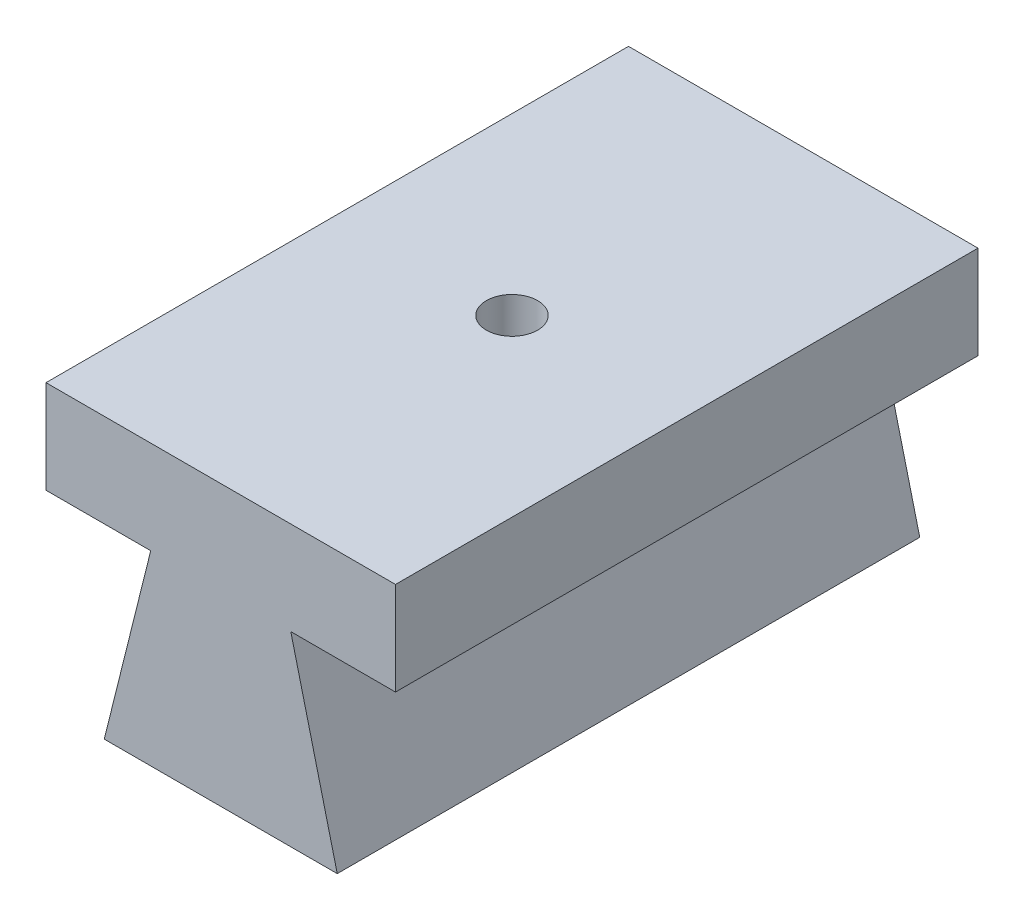
ISO-10303-21;
HEADER;
FILE_DESCRIPTION(('STEP AP214'),'2;1');
FILE_NAME('part.step','',(''),(''),'','','');
FILE_SCHEMA(('AUTOMOTIVE_DESIGN { 1 0 10303 214 1 1 1 1 }'));
ENDSEC;
DATA;
#1=APPLICATION_CONTEXT('core data for automotive mechanical design processes');
#2=APPLICATION_PROTOCOL_DEFINITION('international standard','automotive_design',2000,#1);
#3=PRODUCT_CONTEXT('',#1,'mechanical');
#4=PRODUCT('Part','Part','',(#3));
#5=PRODUCT_RELATED_PRODUCT_CATEGORY('part','',(#4));
#6=PRODUCT_DEFINITION_FORMATION('','',#4);
#7=PRODUCT_DEFINITION_CONTEXT('part definition',#1,'design');
#8=PRODUCT_DEFINITION('design','',#6,#7);
#9=PRODUCT_DEFINITION_SHAPE('','',#8);
#10=(LENGTH_UNIT() NAMED_UNIT(*) SI_UNIT(.MILLI.,.METRE.));
#11=(NAMED_UNIT(*) PLANE_ANGLE_UNIT() SI_UNIT($,.RADIAN.));
#12=(NAMED_UNIT(*) SI_UNIT($,.STERADIAN.) SOLID_ANGLE_UNIT());
#13=UNCERTAINTY_MEASURE_WITH_UNIT(LENGTH_MEASURE(1.E-05),#10,'distance_accuracy_value','');
#14=(GEOMETRIC_REPRESENTATION_CONTEXT(3) GLOBAL_UNCERTAINTY_ASSIGNED_CONTEXT((#13)) GLOBAL_UNIT_ASSIGNED_CONTEXT((#10,
#11,#12)) REPRESENTATION_CONTEXT('',''));
#15=CARTESIAN_POINT('',(0.,0.,0.));
#16=DIRECTION('',(0.,0.,1.));
#17=DIRECTION('',(1.,0.,0.));
#18=AXIS2_PLACEMENT_3D('',#15,#16,#17);
#19=CARTESIAN_POINT('',(-6.35,0.,15.875));
#20=DIRECTION('',(0.970295726275996,-0.241921895599668,0.));
#21=DIRECTION('',(0.241921895599668,0.970295726275996,0.));
#22=AXIS2_PLACEMENT_3D('',#19,#20,#21);
#23=PLANE('',#22);
#24=DIRECTION('',(-0.241921895599668,-0.970295726275996,0.));
#25=VECTOR('',#24,1.);
#26=CARTESIAN_POINT('',(-6.35,0.,-15.875));
#27=LINE('',#26,#25);
#28=CARTESIAN_POINT('',(-3.81682749111328,10.16,-15.875));
#29=VERTEX_POINT('',#28);
#30=CARTESIAN_POINT('',(-6.35,0.,-15.875));
#31=VERTEX_POINT('',#30);
#32=EDGE_CURVE('E128',#29,#31,#27,.T.);
#33=ORIENTED_EDGE('',*,*,#32,.T.);
#34=DIRECTION('',(0.,0.,-1.));
#35=VECTOR('',#34,1.);
#36=CARTESIAN_POINT('',(-6.35,0.,15.875));
#37=LINE('',#36,#35);
#38=CARTESIAN_POINT('',(-6.35,0.,15.875));
#39=VERTEX_POINT('',#38);
#40=EDGE_CURVE('E11',#39,#31,#37,.T.);
#41=ORIENTED_EDGE('',*,*,#40,.F.);
#42=DIRECTION('',(-0.241921895599668,-0.970295726275996,0.));
#43=VECTOR('',#42,1.);
#44=CARTESIAN_POINT('',(-6.35,0.,15.875));
#45=LINE('',#44,#43);
#46=CARTESIAN_POINT('',(-3.81682749111328,10.16,15.875));
#47=VERTEX_POINT('',#46);
#48=EDGE_CURVE('E143',#47,#39,#45,.T.);
#49=ORIENTED_EDGE('',*,*,#48,.F.);
#50=DIRECTION('',(0.,0.,-1.));
#51=VECTOR('',#50,1.);
#52=CARTESIAN_POINT('',(-3.81682749111328,10.16,15.875));
#53=LINE('',#52,#51);
#54=EDGE_CURVE('E124',#47,#29,#53,.T.);
#55=ORIENTED_EDGE('',*,*,#54,.T.);
#56=EDGE_LOOP('',(#33,#41,#49,#55));
#57=FACE_BOUND('',#56,.T.);
#58=ADVANCED_FACE('F32',(#57),#23,.F.);
#59=CARTESIAN_POINT('',(6.35,0.,15.875));
#60=DIRECTION('',(0.,1.,0.));
#61=DIRECTION('',(0.,0.,1.));
#62=AXIS2_PLACEMENT_3D('',#59,#60,#61);
#63=PLANE('',#62);
#64=DIRECTION('',(1.,0.,0.));
#65=VECTOR('',#64,1.);
#66=CARTESIAN_POINT('',(6.35,0.,-15.875));
#67=LINE('',#66,#65);
#68=CARTESIAN_POINT('',(6.35,0.,-15.875));
#69=VERTEX_POINT('',#68);
#70=EDGE_CURVE('E131',#31,#69,#67,.T.);
#71=ORIENTED_EDGE('',*,*,#70,.T.);
#72=DIRECTION('',(0.,0.,-1.));
#73=VECTOR('',#72,1.);
#74=CARTESIAN_POINT('',(6.35,0.,15.875));
#75=LINE('',#74,#73);
#76=CARTESIAN_POINT('',(6.35,0.,15.875));
#77=VERTEX_POINT('',#76);
#78=EDGE_CURVE('E40',#77,#69,#75,.T.);
#79=ORIENTED_EDGE('',*,*,#78,.F.);
#80=DIRECTION('',(1.,0.,0.));
#81=VECTOR('',#80,1.);
#82=CARTESIAN_POINT('',(6.35,0.,15.875));
#83=LINE('',#82,#81);
#84=EDGE_CURVE('E91',#39,#77,#83,.T.);
#85=ORIENTED_EDGE('',*,*,#84,.F.);
#86=ORIENTED_EDGE('',*,*,#40,.T.);
#87=EDGE_LOOP('',(#71,#79,#85,#86));
#88=FACE_BOUND('',#87,.T.);
#89=ADVANCED_FACE('F200',(#88),#63,.F.);
#90=CARTESIAN_POINT('',(6.35,0.,15.875));
#91=DIRECTION('',(-0.970295726275996,-0.241921895599668,0.));
#92=DIRECTION('',(0.241921895599668,-0.970295726275996,0.));
#93=AXIS2_PLACEMENT_3D('',#90,#91,#92);
#94=PLANE('',#93);
#95=DIRECTION('',(-0.241921895599668,0.970295726275996,0.));
#96=VECTOR('',#95,1.);
#97=CARTESIAN_POINT('',(6.35,0.,-15.875));
#98=LINE('',#97,#96);
#99=CARTESIAN_POINT('',(3.81682749111328,10.16,-15.875));
#100=VERTEX_POINT('',#99);
#101=EDGE_CURVE('E134',#69,#100,#98,.T.);
#102=ORIENTED_EDGE('',*,*,#101,.T.);
#103=DIRECTION('',(0.,0.,-1.));
#104=VECTOR('',#103,1.);
#105=CARTESIAN_POINT('',(3.81682749111328,10.16,15.875));
#106=LINE('',#105,#104);
#107=CARTESIAN_POINT('',(3.81682749111328,10.16,15.875));
#108=VERTEX_POINT('',#107);
#109=EDGE_CURVE('E150',#108,#100,#106,.T.);
#110=ORIENTED_EDGE('',*,*,#109,.F.);
#111=DIRECTION('',(-0.241921895599668,0.970295726275996,0.));
#112=VECTOR('',#111,1.);
#113=CARTESIAN_POINT('',(6.35,0.,15.875));
#114=LINE('',#113,#112);
#115=EDGE_CURVE('E158',#77,#108,#114,.T.);
#116=ORIENTED_EDGE('',*,*,#115,.F.);
#117=ORIENTED_EDGE('',*,*,#78,.T.);
#118=EDGE_LOOP('',(#102,#110,#116,#117));
#119=FACE_BOUND('',#118,.T.);
#120=ADVANCED_FACE('F156',(#119),#94,.F.);
#121=CARTESIAN_POINT('',(3.81682749111328,10.16,15.875));
#122=DIRECTION('',(0.,1.,0.));
#123=DIRECTION('',(-1.,0.,0.));
#124=AXIS2_PLACEMENT_3D('',#121,#122,#123);
#125=PLANE('',#124);
#126=DIRECTION('',(1.,0.,0.));
#127=VECTOR('',#126,1.);
#128=CARTESIAN_POINT('',(3.81682749111328,10.16,-15.875));
#129=LINE('',#128,#127);
#130=CARTESIAN_POINT('',(9.525,10.16,-15.875));
#131=VERTEX_POINT('',#130);
#132=EDGE_CURVE('E136',#100,#131,#129,.T.);
#133=ORIENTED_EDGE('',*,*,#132,.T.);
#134=DIRECTION('',(0.,0.,-1.));
#135=VECTOR('',#134,1.);
#136=CARTESIAN_POINT('',(9.525,10.16,15.875));
#137=LINE('',#136,#135);
#138=CARTESIAN_POINT('',(9.525,10.16,15.875));
#139=VERTEX_POINT('',#138);
#140=EDGE_CURVE('E147',#139,#131,#137,.T.);
#141=ORIENTED_EDGE('',*,*,#140,.F.);
#142=DIRECTION('',(1.,0.,0.));
#143=VECTOR('',#142,1.);
#144=CARTESIAN_POINT('',(3.81682749111328,10.16,15.875));
#145=LINE('',#144,#143);
#146=EDGE_CURVE('E170',#108,#139,#145,.T.);
#147=ORIENTED_EDGE('',*,*,#146,.F.);
#148=ORIENTED_EDGE('',*,*,#109,.T.);
#149=EDGE_LOOP('',(#133,#141,#147,#148));
#150=FACE_BOUND('',#149,.T.);
#151=ADVANCED_FACE('F166',(#150),#125,.F.);
#152=CARTESIAN_POINT('',(9.525,10.16,15.875));
#153=DIRECTION('',(-1.,0.,0.));
#154=DIRECTION('',(0.,-1.,0.));
#155=AXIS2_PLACEMENT_3D('',#152,#153,#154);
#156=PLANE('',#155);
#157=DIRECTION('',(0.,1.,0.));
#158=VECTOR('',#157,1.);
#159=CARTESIAN_POINT('',(9.525,10.16,-15.875));
#160=LINE('',#159,#158);
#161=CARTESIAN_POINT('',(9.525,15.24,-15.875));
#162=VERTEX_POINT('',#161);
#163=EDGE_CURVE('E138',#131,#162,#160,.T.);
#164=ORIENTED_EDGE('',*,*,#163,.T.);
#165=DIRECTION('',(0.,0.,-1.));
#166=VECTOR('',#165,1.);
#167=CARTESIAN_POINT('',(9.525,15.24,15.875));
#168=LINE('',#167,#166);
#169=CARTESIAN_POINT('',(9.525,15.24,15.875));
#170=VERTEX_POINT('',#169);
#171=EDGE_CURVE('E119',#170,#162,#168,.T.);
#172=ORIENTED_EDGE('',*,*,#171,.F.);
#173=DIRECTION('',(0.,1.,0.));
#174=VECTOR('',#173,1.);
#175=CARTESIAN_POINT('',(9.525,10.16,15.875));
#176=LINE('',#175,#174);
#177=EDGE_CURVE('E110',#139,#170,#176,.T.);
#178=ORIENTED_EDGE('',*,*,#177,.F.);
#179=ORIENTED_EDGE('',*,*,#140,.T.);
#180=EDGE_LOOP('',(#164,#172,#178,#179));
#181=FACE_BOUND('',#180,.T.);
#182=ADVANCED_FACE('F169',(#181),#156,.F.);
#183=CARTESIAN_POINT('',(-9.525,15.24,15.875));
#184=DIRECTION('',(0.,-1.,0.));
#185=DIRECTION('',(0.,0.,-1.));
#186=AXIS2_PLACEMENT_3D('',#183,#184,#185);
#187=PLANE('',#186);
#188=CARTESIAN_POINT('',(0.,15.24,0.));
#189=DIRECTION('',(0.,1.,0.));
#190=DIRECTION('',(0.,0.,1.));
#191=AXIS2_PLACEMENT_3D('',#188,#189,#190);
#192=CIRCLE('',#191,1.397);
#193=CARTESIAN_POINT('',(0.,15.24,1.397));
#194=VERTEX_POINT('',#193);
#195=EDGE_CURVE('E176',#194,#194,#192,.T.);
#196=ORIENTED_EDGE('',*,*,#195,.F.);
#197=EDGE_LOOP('',(#196));
#198=FACE_BOUND('',#197,.T.);
#199=DIRECTION('',(-1.,0.,0.));
#200=VECTOR('',#199,1.);
#201=CARTESIAN_POINT('',(-9.525,15.24,-15.875));
#202=LINE('',#201,#200);
#203=CARTESIAN_POINT('',(-9.525,15.24,-15.875));
#204=VERTEX_POINT('',#203);
#205=EDGE_CURVE('E118',#162,#204,#202,.T.);
#206=ORIENTED_EDGE('',*,*,#205,.T.);
#207=DIRECTION('',(0.,0.,-1.));
#208=VECTOR('',#207,1.);
#209=CARTESIAN_POINT('',(-9.525,15.24,15.875));
#210=LINE('',#209,#208);
#211=CARTESIAN_POINT('',(-9.525,15.24,15.875));
#212=VERTEX_POINT('',#211);
#213=EDGE_CURVE('E115',#212,#204,#210,.T.);
#214=ORIENTED_EDGE('',*,*,#213,.F.);
#215=DIRECTION('',(-1.,0.,0.));
#216=VECTOR('',#215,1.);
#217=CARTESIAN_POINT('',(-9.525,15.24,15.875));
#218=LINE('',#217,#216);
#219=EDGE_CURVE('E104',#170,#212,#218,.T.);
#220=ORIENTED_EDGE('',*,*,#219,.F.);
#221=ORIENTED_EDGE('',*,*,#171,.T.);
#222=EDGE_LOOP('',(#206,#214,#220,#221));
#223=FACE_BOUND('',#222,.T.);
#224=ADVANCED_FACE('F116',(#198,#223),#187,.F.);
#225=CARTESIAN_POINT('',(-9.525,10.16,15.875));
#226=DIRECTION('',(1.,0.,0.));
#227=DIRECTION('',(0.,1.,0.));
#228=AXIS2_PLACEMENT_3D('',#225,#226,#227);
#229=PLANE('',#228);
#230=DIRECTION('',(0.,-1.,0.));
#231=VECTOR('',#230,1.);
#232=CARTESIAN_POINT('',(-9.525,10.16,-15.875));
#233=LINE('',#232,#231);
#234=CARTESIAN_POINT('',(-9.525,10.16,-15.875));
#235=VERTEX_POINT('',#234);
#236=EDGE_CURVE('E77',#204,#235,#233,.T.);
#237=ORIENTED_EDGE('',*,*,#236,.T.);
#238=DIRECTION('',(0.,0.,-1.));
#239=VECTOR('',#238,1.);
#240=CARTESIAN_POINT('',(-9.525,10.16,15.875));
#241=LINE('',#240,#239);
#242=CARTESIAN_POINT('',(-9.525,10.16,15.875));
#243=VERTEX_POINT('',#242);
#244=EDGE_CURVE('E120',#243,#235,#241,.T.);
#245=ORIENTED_EDGE('',*,*,#244,.F.);
#246=DIRECTION('',(0.,-1.,0.));
#247=VECTOR('',#246,1.);
#248=CARTESIAN_POINT('',(-9.525,10.16,15.875));
#249=LINE('',#248,#247);
#250=EDGE_CURVE('E108',#212,#243,#249,.T.);
#251=ORIENTED_EDGE('',*,*,#250,.F.);
#252=ORIENTED_EDGE('',*,*,#213,.T.);
#253=EDGE_LOOP('',(#237,#245,#251,#252));
#254=FACE_BOUND('',#253,.T.);
#255=ADVANCED_FACE('F122',(#254),#229,.F.);
#256=CARTESIAN_POINT('',(-3.81682749111328,10.16,15.875));
#257=DIRECTION('',(0.,1.,0.));
#258=DIRECTION('',(-1.,0.,0.));
#259=AXIS2_PLACEMENT_3D('',#256,#257,#258);
#260=PLANE('',#259);
#261=DIRECTION('',(1.,0.,0.));
#262=VECTOR('',#261,1.);
#263=CARTESIAN_POINT('',(-3.81682749111328,10.16,-15.875));
#264=LINE('',#263,#262);
#265=EDGE_CURVE('E83',#235,#29,#264,.T.);
#266=ORIENTED_EDGE('',*,*,#265,.T.);
#267=ORIENTED_EDGE('',*,*,#54,.F.);
#268=DIRECTION('',(1.,0.,0.));
#269=VECTOR('',#268,1.);
#270=CARTESIAN_POINT('',(-3.81682749111328,10.16,15.875));
#271=LINE('',#270,#269);
#272=EDGE_CURVE('E48',#243,#47,#271,.T.);
#273=ORIENTED_EDGE('',*,*,#272,.F.);
#274=ORIENTED_EDGE('',*,*,#244,.T.);
#275=EDGE_LOOP('',(#266,#267,#273,#274));
#276=FACE_BOUND('',#275,.T.);
#277=ADVANCED_FACE('F196',(#276),#260,.F.);
#278=CARTESIAN_POINT('',(-3.81682749111328,10.16,15.875));
#279=DIRECTION('',(0.,0.,-1.));
#280=DIRECTION('',(-1.,0.,0.));
#281=AXIS2_PLACEMENT_3D('',#278,#279,#280);
#282=PLANE('',#281);
#283=ORIENTED_EDGE('',*,*,#48,.T.);
#284=ORIENTED_EDGE('',*,*,#84,.T.);
#285=ORIENTED_EDGE('',*,*,#115,.T.);
#286=ORIENTED_EDGE('',*,*,#146,.T.);
#287=ORIENTED_EDGE('',*,*,#177,.T.);
#288=ORIENTED_EDGE('',*,*,#219,.T.);
#289=ORIENTED_EDGE('',*,*,#250,.T.);
#290=ORIENTED_EDGE('',*,*,#272,.T.);
#291=EDGE_LOOP('',(#283,#284,#285,#286,#287,#288,#289,#290));
#292=FACE_BOUND('',#291,.T.);
#293=ADVANCED_FACE('F106',(#292),#282,.F.);
#294=CARTESIAN_POINT('',(-3.81682749111328,10.16,-15.875));
#295=DIRECTION('',(0.,0.,-1.));
#296=DIRECTION('',(-1.,0.,0.));
#297=AXIS2_PLACEMENT_3D('',#294,#295,#296);
#298=PLANE('',#297);
#299=ORIENTED_EDGE('',*,*,#32,.F.);
#300=ORIENTED_EDGE('',*,*,#265,.F.);
#301=ORIENTED_EDGE('',*,*,#236,.F.);
#302=ORIENTED_EDGE('',*,*,#205,.F.);
#303=ORIENTED_EDGE('',*,*,#163,.F.);
#304=ORIENTED_EDGE('',*,*,#132,.F.);
#305=ORIENTED_EDGE('',*,*,#101,.F.);
#306=ORIENTED_EDGE('',*,*,#70,.F.);
#307=EDGE_LOOP('',(#299,#300,#301,#302,#303,#304,#305,#306));
#308=FACE_BOUND('',#307,.T.);
#309=ADVANCED_FACE('F162',(#308),#298,.T.);
#310=CARTESIAN_POINT('',(0.,2.54,0.));
#311=DIRECTION('',(0.,1.,0.));
#312=DIRECTION('',(0.,0.,1.));
#313=AXIS2_PLACEMENT_3D('',#310,#311,#312);
#314=CYLINDRICAL_SURFACE('',#313,1.397);
#315=CARTESIAN_POINT('',(0.,2.54,0.));
#316=DIRECTION('',(0.,1.,0.));
#317=DIRECTION('',(0.,0.,1.));
#318=AXIS2_PLACEMENT_3D('',#315,#316,#317);
#319=CIRCLE('',#318,1.397);
#320=CARTESIAN_POINT('',(0.,2.54,1.397));
#321=VERTEX_POINT('',#320);
#322=EDGE_CURVE('E132',#321,#321,#319,.T.);
#323=ORIENTED_EDGE('',*,*,#322,.F.);
#324=EDGE_LOOP('',(#323));
#325=FACE_BOUND('',#324,.T.);
#326=ORIENTED_EDGE('',*,*,#195,.T.);
#327=EDGE_LOOP('',(#326));
#328=FACE_BOUND('',#327,.T.);
#329=ADVANCED_FACE('F184',(#325,#328),#314,.F.);
#330=CARTESIAN_POINT('',(0.,2.54,0.));
#331=DIRECTION('',(0.,1.,0.));
#332=DIRECTION('',(0.,0.,1.));
#333=AXIS2_PLACEMENT_3D('',#330,#331,#332);
#334=PLANE('',#333);
#335=ORIENTED_EDGE('',*,*,#322,.T.);
#336=EDGE_LOOP('',(#335));
#337=FACE_BOUND('',#336,.T.);
#338=ADVANCED_FACE('F182',(#337),#334,.T.);
#339=CLOSED_SHELL('',(#58,#89,#120,#151,#182,#224,#255,#277,#293,#309,#329,#338));
#340=MANIFOLD_SOLID_BREP('B2',#339);
#341=ADVANCED_BREP_SHAPE_REPRESENTATION('',(#18,#340),#14);
#342=SHAPE_DEFINITION_REPRESENTATION(#9,#341);
ENDSEC;
END-ISO-10303-21;
